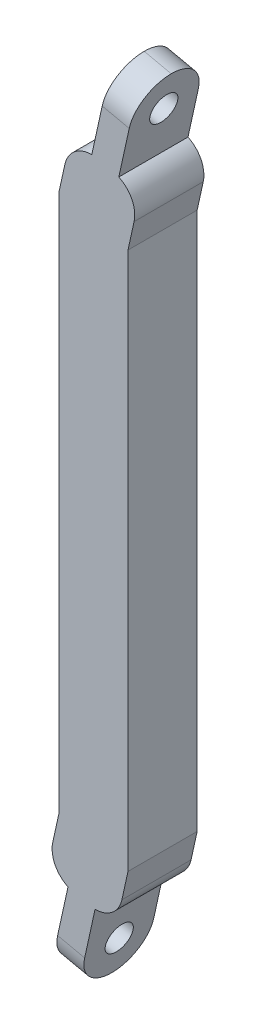
ISO-10303-21;
HEADER;
FILE_DESCRIPTION(('STEP AP214'),'2;1');
FILE_NAME('part.step','',(''),(''),'','','');
FILE_SCHEMA(('AUTOMOTIVE_DESIGN { 1 0 10303 214 1 1 1 1 }'));
ENDSEC;
DATA;
#1=APPLICATION_CONTEXT('core data for automotive mechanical design processes');
#2=APPLICATION_PROTOCOL_DEFINITION('international standard','automotive_design',2000,#1);
#3=PRODUCT_CONTEXT('',#1,'mechanical');
#4=PRODUCT('Part','Part','',(#3));
#5=PRODUCT_RELATED_PRODUCT_CATEGORY('part','',(#4));
#6=PRODUCT_DEFINITION_FORMATION('','',#4);
#7=PRODUCT_DEFINITION_CONTEXT('part definition',#1,'design');
#8=PRODUCT_DEFINITION('design','',#6,#7);
#9=PRODUCT_DEFINITION_SHAPE('','',#8);
#10=(LENGTH_UNIT() NAMED_UNIT(*) SI_UNIT(.MILLI.,.METRE.));
#11=(NAMED_UNIT(*) PLANE_ANGLE_UNIT() SI_UNIT($,.RADIAN.));
#12=(NAMED_UNIT(*) SI_UNIT($,.STERADIAN.) SOLID_ANGLE_UNIT());
#13=UNCERTAINTY_MEASURE_WITH_UNIT(LENGTH_MEASURE(1.E-05),#10,'distance_accuracy_value','');
#14=(GEOMETRIC_REPRESENTATION_CONTEXT(3) GLOBAL_UNCERTAINTY_ASSIGNED_CONTEXT((#13)) GLOBAL_UNIT_ASSIGNED_CONTEXT((#10,
#11,#12)) REPRESENTATION_CONTEXT('',''));
#15=CARTESIAN_POINT('',(0.,0.,0.));
#16=DIRECTION('',(0.,0.,1.));
#17=DIRECTION('',(1.,0.,0.));
#18=AXIS2_PLACEMENT_3D('',#15,#16,#17);
#19=CARTESIAN_POINT('',(-15.875,127.,-15.875));
#20=DIRECTION('',(1.,0.,0.));
#21=DIRECTION('',(0.,0.,-1.));
#22=AXIS2_PLACEMENT_3D('',#19,#20,#21);
#23=PLANE('',#22);
#24=DIRECTION('',(0.,-1.,0.));
#25=VECTOR('',#24,1.);
#26=CARTESIAN_POINT('',(-15.875,127.,-15.875));
#27=LINE('',#26,#25);
#28=CARTESIAN_POINT('',(-15.875,127.,-15.875));
#29=VERTEX_POINT('',#28);
#30=CARTESIAN_POINT('',(-15.8750000000005,-120.017182130584,-15.875));
#31=VERTEX_POINT('',#30);
#32=EDGE_CURVE('E295',#29,#31,#27,.T.);
#33=ORIENTED_EDGE('',*,*,#32,.T.);
#34=DIRECTION('',(0.,0.,-1.));
#35=VECTOR('',#34,1.);
#36=CARTESIAN_POINT('',(-15.8750000000005,-120.017182130584,15.875));
#37=LINE('',#36,#35);
#38=CARTESIAN_POINT('',(-15.8750000000005,-120.017182130584,15.875));
#39=VERTEX_POINT('',#38);
#40=EDGE_CURVE('E244',#39,#31,#37,.T.);
#41=ORIENTED_EDGE('',*,*,#40,.F.);
#42=DIRECTION('',(0.,-1.,0.));
#43=VECTOR('',#42,1.);
#44=CARTESIAN_POINT('',(-15.875,127.,15.875));
#45=LINE('',#44,#43);
#46=CARTESIAN_POINT('',(-15.875,127.,15.875));
#47=VERTEX_POINT('',#46);
#48=EDGE_CURVE('E306',#47,#39,#45,.T.);
#49=ORIENTED_EDGE('',*,*,#48,.F.);
#50=DIRECTION('',(0.,0.,1.));
#51=VECTOR('',#50,1.);
#52=CARTESIAN_POINT('',(-15.875,127.,-15.875));
#53=LINE('',#52,#51);
#54=EDGE_CURVE('E293',#29,#47,#53,.T.);
#55=ORIENTED_EDGE('',*,*,#54,.F.);
#56=EDGE_LOOP('',(#33,#41,#49,#55));
#57=FACE_BOUND('',#56,.T.);
#58=ADVANCED_FACE('F33',(#57),#23,.F.);
#59=CARTESIAN_POINT('',(-15.875,127.,15.875));
#60=DIRECTION('',(0.,0.,-1.));
#61=DIRECTION('',(-1.,0.,0.));
#62=AXIS2_PLACEMENT_3D('',#59,#60,#61);
#63=PLANE('',#62);
#64=DIRECTION('',(0.214797756747001,0.976658550209057,0.));
#65=VECTOR('',#64,1.);
#66=CARTESIAN_POINT('',(-11.6592062074002,-146.951409086287,15.875));
#67=LINE('',#66,#65);
#68=CARTESIAN_POINT('',(-16.4330863511022,-168.657645364683,15.875));
#69=VERTEX_POINT('',#68);
#70=CARTESIAN_POINT('',(-11.6592062074002,-146.951409086287,15.875));
#71=VERTEX_POINT('',#70);
#72=EDGE_CURVE('E221',#69,#71,#67,.T.);
#73=ORIENTED_EDGE('',*,*,#72,.F.);
#74=DIRECTION('',(-0.976658550209054,0.214797756747012,0.));
#75=VECTOR('',#74,1.);
#76=CARTESIAN_POINT('',(-4.02952276344705,-171.38557687537,15.875));
#77=LINE('',#76,#75);
#78=CARTESIAN_POINT('',(-4.02952276344722,-171.38557687537,15.875));
#79=VERTEX_POINT('',#78);
#80=EDGE_CURVE('E209',#69,#79,#77,.F.);
#81=ORIENTED_EDGE('',*,*,#80,.T.);
#82=DIRECTION('',(-0.214797756747001,-0.976658550209057,0.));
#83=VECTOR('',#82,1.);
#84=CARTESIAN_POINT('',(0.74435738025485,-149.679340596974,15.875));
#85=LINE('',#84,#83);
#86=CARTESIAN_POINT('',(0.74435738025485,-149.679340596974,15.875));
#87=VERTEX_POINT('',#86);
#88=EDGE_CURVE('E200',#87,#79,#85,.T.);
#89=ORIENTED_EDGE('',*,*,#88,.F.);
#90=CARTESIAN_POINT('',(0.676670230090281,-136.979520974251,15.875));
#91=DIRECTION('',(0.,0.,-1.));
#92=DIRECTION('',(-1.,0.,0.));
#93=AXIS2_PLACEMENT_3D('',#90,#91,#92);
#94=CIRCLE('',#93,12.7);
#95=CARTESIAN_POINT('',(13.0802338177453,-139.707452484938,15.875));
#96=VERTEX_POINT('',#95);
#97=EDGE_CURVE('E184',#87,#96,#94,.F.);
#98=ORIENTED_EDGE('',*,*,#97,.T.);
#99=DIRECTION('',(-0.214797756747001,-0.976658550209056,0.));
#100=VECTOR('',#99,1.);
#101=CARTESIAN_POINT('',(15.8749999999996,-127.,15.875));
#102=LINE('',#101,#100);
#103=CARTESIAN_POINT('',(15.8749999999996,-127.,15.875));
#104=VERTEX_POINT('',#103);
#105=EDGE_CURVE('E239',#104,#96,#102,.T.);
#106=ORIENTED_EDGE('',*,*,#105,.F.);
#107=DIRECTION('',(0.,-1.,0.));
#108=VECTOR('',#107,1.);
#109=CARTESIAN_POINT('',(15.875,127.,15.875));
#110=LINE('',#109,#108);
#111=CARTESIAN_POINT('',(15.875,120.017182130584,15.875));
#112=VERTEX_POINT('',#111);
#113=EDGE_CURVE('E303',#112,#104,#110,.T.);
#114=ORIENTED_EDGE('',*,*,#113,.F.);
#115=DIRECTION('',(-0.214797756747012,-0.976658550209054,0.));
#116=VECTOR('',#115,1.);
#117=CARTESIAN_POINT('',(15.875,120.017182130584,15.875));
#118=LINE('',#117,#116);
#119=CARTESIAN_POINT('',(18.6699211657765,132.725339306224,15.875));
#120=VERTEX_POINT('',#119);
#121=EDGE_CURVE('E263',#120,#112,#118,.T.);
#122=ORIENTED_EDGE('',*,*,#121,.F.);
#123=CARTESIAN_POINT('',(6.26635757812156,135.453270816911,15.875));
#124=DIRECTION('',(0.,0.,-1.));
#125=DIRECTION('',(-1.,0.,0.));
#126=AXIS2_PLACEMENT_3D('',#123,#124,#125);
#127=CIRCLE('',#126,12.7);
#128=CARTESIAN_POINT('',(11.6592062074004,146.951409086287,15.875));
#129=VERTEX_POINT('',#128);
#130=EDGE_CURVE('E195',#120,#129,#127,.F.);
#131=ORIENTED_EDGE('',*,*,#130,.T.);
#132=DIRECTION('',(-0.214797756746998,-0.976658550209057,0.));
#133=VECTOR('',#132,1.);
#134=CARTESIAN_POINT('',(19.843000739461,184.162099849252,15.875));
#135=LINE('',#134,#133);
#136=CARTESIAN_POINT('',(16.4330863511024,168.657645364683,15.875));
#137=VERTEX_POINT('',#136);
#138=EDGE_CURVE('E227',#137,#129,#135,.T.);
#139=ORIENTED_EDGE('',*,*,#138,.F.);
#140=DIRECTION('',(0.976658550209055,-0.21479775674701,0.));
#141=VECTOR('',#140,1.);
#142=CARTESIAN_POINT('',(4.02952276344725,171.38557687537,15.875));
#143=LINE('',#142,#141);
#144=CARTESIAN_POINT('',(4.02952276344726,171.38557687537,15.875));
#145=VERTEX_POINT('',#144);
#146=EDGE_CURVE('E342',#137,#145,#143,.F.);
#147=ORIENTED_EDGE('',*,*,#146,.T.);
#148=DIRECTION('',(0.214797756747009,0.976658550209055,0.));
#149=VECTOR('',#148,1.);
#150=CARTESIAN_POINT('',(39.9464552849093,334.695379433892,15.875));
#151=LINE('',#150,#149);
#152=CARTESIAN_POINT('',(-0.744357380255023,149.679340596974,15.875));
#153=VERTEX_POINT('',#152);
#154=EDGE_CURVE('E219',#153,#145,#151,.T.);
#155=ORIENTED_EDGE('',*,*,#154,.F.);
#156=CARTESIAN_POINT('',(-0.676670230090536,136.979520974251,15.875));
#157=DIRECTION('',(0.,0.,-1.));
#158=DIRECTION('',(-1.,0.,0.));
#159=AXIS2_PLACEMENT_3D('',#156,#157,#158);
#160=CIRCLE('',#159,12.7);
#161=CARTESIAN_POINT('',(-13.0802338177455,139.707452484938,15.875));
#162=VERTEX_POINT('',#161);
#163=EDGE_CURVE('E326',#153,#162,#160,.F.);
#164=ORIENTED_EDGE('',*,*,#163,.T.);
#165=DIRECTION('',(0.214797756747012,0.976658550209054,0.));
#166=VECTOR('',#165,1.);
#167=CARTESIAN_POINT('',(-15.875,127.,15.875));
#168=LINE('',#167,#166);
#169=EDGE_CURVE('E260',#47,#162,#168,.T.);
#170=ORIENTED_EDGE('',*,*,#169,.F.);
#171=ORIENTED_EDGE('',*,*,#48,.T.);
#172=DIRECTION('',(0.214797756747,0.976658550209057,0.));
#173=VECTOR('',#172,1.);
#174=CARTESIAN_POINT('',(-15.8750000000005,-120.017182130584,15.875));
#175=LINE('',#174,#173);
#176=CARTESIAN_POINT('',(-18.6699211657769,-132.725339306224,15.875));
#177=VERTEX_POINT('',#176);
#178=EDGE_CURVE('E241',#177,#39,#175,.T.);
#179=ORIENTED_EDGE('',*,*,#178,.F.);
#180=CARTESIAN_POINT('',(-6.26635757812182,-135.453270816911,15.875));
#181=DIRECTION('',(0.,0.,-1.));
#182=DIRECTION('',(-1.,0.,0.));
#183=AXIS2_PLACEMENT_3D('',#180,#181,#182);
#184=CIRCLE('',#183,12.7);
#185=EDGE_CURVE('E194',#177,#71,#184,.F.);
#186=ORIENTED_EDGE('',*,*,#185,.T.);
#187=EDGE_LOOP('',(#73,#81,#89,#98,#106,#114,#122,#131,#139,#147,#155,#164,#170,#171,#179,#186));
#188=FACE_BOUND('',#187,.T.);
#189=ADVANCED_FACE('F207',(#188),#63,.F.);
#190=CARTESIAN_POINT('',(15.875,127.,-15.875));
#191=DIRECTION('',(-1.,0.,0.));
#192=DIRECTION('',(0.,0.,1.));
#193=AXIS2_PLACEMENT_3D('',#190,#191,#192);
#194=PLANE('',#193);
#195=DIRECTION('',(0.,-1.,0.));
#196=VECTOR('',#195,1.);
#197=CARTESIAN_POINT('',(15.875,127.,-15.875));
#198=LINE('',#197,#196);
#199=CARTESIAN_POINT('',(15.875,120.017182130584,-15.875));
#200=VERTEX_POINT('',#199);
#201=CARTESIAN_POINT('',(15.875,-127.,-15.875));
#202=VERTEX_POINT('',#201);
#203=EDGE_CURVE('E300',#200,#202,#198,.T.);
#204=ORIENTED_EDGE('',*,*,#203,.F.);
#205=DIRECTION('',(0.,0.,-1.));
#206=VECTOR('',#205,1.);
#207=CARTESIAN_POINT('',(15.875,120.017182130584,15.875));
#208=LINE('',#207,#206);
#209=EDGE_CURVE('E266',#112,#200,#208,.T.);
#210=ORIENTED_EDGE('',*,*,#209,.F.);
#211=ORIENTED_EDGE('',*,*,#113,.T.);
#212=DIRECTION('',(0.,0.,-1.));
#213=VECTOR('',#212,1.);
#214=CARTESIAN_POINT('',(15.875,-127.,-15.875));
#215=LINE('',#214,#213);
#216=EDGE_CURVE('E292',#104,#202,#215,.T.);
#217=ORIENTED_EDGE('',*,*,#216,.T.);
#218=EDGE_LOOP('',(#204,#210,#211,#217));
#219=FACE_BOUND('',#218,.T.);
#220=ADVANCED_FACE('F387',(#219),#194,.F.);
#221=CARTESIAN_POINT('',(-15.875,127.,-15.875));
#222=DIRECTION('',(0.,0.,1.));
#223=DIRECTION('',(1.,0.,0.));
#224=AXIS2_PLACEMENT_3D('',#221,#222,#223);
#225=PLANE('',#224);
#226=DIRECTION('',(0.214797756747001,0.976658550209057,0.));
#227=VECTOR('',#226,1.);
#228=CARTESIAN_POINT('',(0.744357380254849,-149.679340596974,-15.875));
#229=LINE('',#228,#227);
#230=CARTESIAN_POINT('',(-4.02952276344722,-171.38557687537,-15.875));
#231=VERTEX_POINT('',#230);
#232=CARTESIAN_POINT('',(0.74435738025485,-149.679340596974,-15.875));
#233=VERTEX_POINT('',#232);
#234=EDGE_CURVE('E202',#231,#233,#229,.T.);
#235=ORIENTED_EDGE('',*,*,#234,.F.);
#236=DIRECTION('',(-0.976658550209054,0.214797756747012,0.));
#237=VECTOR('',#236,1.);
#238=CARTESIAN_POINT('',(-16.433086351102,-168.657645364683,-15.875));
#239=LINE('',#238,#237);
#240=CARTESIAN_POINT('',(-16.4330863511022,-168.657645364683,-15.875));
#241=VERTEX_POINT('',#240);
#242=EDGE_CURVE('E352',#231,#241,#239,.T.);
#243=ORIENTED_EDGE('',*,*,#242,.T.);
#244=DIRECTION('',(-0.214797756747001,-0.976658550209057,0.));
#245=VECTOR('',#244,1.);
#246=CARTESIAN_POINT('',(-11.6592062074002,-146.951409086287,-15.875));
#247=LINE('',#246,#245);
#248=CARTESIAN_POINT('',(-11.6592062074002,-146.951409086287,-15.875));
#249=VERTEX_POINT('',#248);
#250=EDGE_CURVE('E216',#249,#241,#247,.T.);
#251=ORIENTED_EDGE('',*,*,#250,.F.);
#252=CARTESIAN_POINT('',(-6.26635757812182,-135.453270816911,-15.875));
#253=DIRECTION('',(0.,0.,1.));
#254=DIRECTION('',(1.,0.,0.));
#255=AXIS2_PLACEMENT_3D('',#252,#253,#254);
#256=CIRCLE('',#255,12.7);
#257=CARTESIAN_POINT('',(-18.6699211657769,-132.725339306224,-15.875));
#258=VERTEX_POINT('',#257);
#259=EDGE_CURVE('E322',#249,#258,#256,.F.);
#260=ORIENTED_EDGE('',*,*,#259,.T.);
#261=DIRECTION('',(0.214797756747,0.976658550209057,0.));
#262=VECTOR('',#261,1.);
#263=CARTESIAN_POINT('',(-15.8750000000005,-120.017182130584,-15.875));
#264=LINE('',#263,#262);
#265=EDGE_CURVE('E242',#258,#31,#264,.T.);
#266=ORIENTED_EDGE('',*,*,#265,.T.);
#267=ORIENTED_EDGE('',*,*,#32,.F.);
#268=DIRECTION('',(0.214797756747012,0.976658550209054,0.));
#269=VECTOR('',#268,1.);
#270=CARTESIAN_POINT('',(-15.875,127.,-15.875));
#271=LINE('',#270,#269);
#272=CARTESIAN_POINT('',(-13.0802338177455,139.707452484938,-15.875));
#273=VERTEX_POINT('',#272);
#274=EDGE_CURVE('E259',#29,#273,#271,.T.);
#275=ORIENTED_EDGE('',*,*,#274,.T.);
#276=CARTESIAN_POINT('',(-0.676670230090536,136.979520974251,-15.875));
#277=DIRECTION('',(0.,0.,1.));
#278=DIRECTION('',(1.,0.,0.));
#279=AXIS2_PLACEMENT_3D('',#276,#277,#278);
#280=CIRCLE('',#279,12.7);
#281=CARTESIAN_POINT('',(-0.744357380255023,149.679340596974,-15.875));
#282=VERTEX_POINT('',#281);
#283=EDGE_CURVE('E315',#273,#282,#280,.F.);
#284=ORIENTED_EDGE('',*,*,#283,.T.);
#285=DIRECTION('',(-0.214797756747009,-0.976658550209055,0.));
#286=VECTOR('',#285,1.);
#287=CARTESIAN_POINT('',(39.9464552849093,334.695379433892,-15.875));
#288=LINE('',#287,#286);
#289=CARTESIAN_POINT('',(4.02952276344726,171.38557687537,-15.875));
#290=VERTEX_POINT('',#289);
#291=EDGE_CURVE('E225',#290,#282,#288,.T.);
#292=ORIENTED_EDGE('',*,*,#291,.F.);
#293=DIRECTION('',(0.976658550209055,-0.21479775674701,0.));
#294=VECTOR('',#293,1.);
#295=CARTESIAN_POINT('',(16.4330863511021,168.657645364683,-15.875));
#296=LINE('',#295,#294);
#297=CARTESIAN_POINT('',(16.4330863511024,168.657645364683,-15.875));
#298=VERTEX_POINT('',#297);
#299=EDGE_CURVE('E350',#290,#298,#296,.T.);
#300=ORIENTED_EDGE('',*,*,#299,.T.);
#301=DIRECTION('',(0.214797756746998,0.976658550209057,0.));
#302=VECTOR('',#301,1.);
#303=CARTESIAN_POINT('',(19.843000739461,184.162099849252,-15.875));
#304=LINE('',#303,#302);
#305=CARTESIAN_POINT('',(11.6592062074004,146.951409086287,-15.875));
#306=VERTEX_POINT('',#305);
#307=EDGE_CURVE('E232',#306,#298,#304,.T.);
#308=ORIENTED_EDGE('',*,*,#307,.F.);
#309=CARTESIAN_POINT('',(6.26635757812156,135.453270816911,-15.875));
#310=DIRECTION('',(0.,0.,1.));
#311=DIRECTION('',(1.,0.,0.));
#312=AXIS2_PLACEMENT_3D('',#309,#310,#311);
#313=CIRCLE('',#312,12.7);
#314=CARTESIAN_POINT('',(18.6699211657765,132.725339306224,-15.875));
#315=VERTEX_POINT('',#314);
#316=EDGE_CURVE('E318',#306,#315,#313,.F.);
#317=ORIENTED_EDGE('',*,*,#316,.T.);
#318=DIRECTION('',(-0.214797756747012,-0.976658550209054,0.));
#319=VECTOR('',#318,1.);
#320=CARTESIAN_POINT('',(15.875,120.017182130584,-15.875));
#321=LINE('',#320,#319);
#322=EDGE_CURVE('E264',#315,#200,#321,.T.);
#323=ORIENTED_EDGE('',*,*,#322,.T.);
#324=ORIENTED_EDGE('',*,*,#203,.T.);
#325=DIRECTION('',(-0.214797756747001,-0.976658550209056,0.));
#326=VECTOR('',#325,1.);
#327=CARTESIAN_POINT('',(15.8749999999996,-127.,-15.875));
#328=LINE('',#327,#326);
#329=CARTESIAN_POINT('',(13.0802338177453,-139.707452484938,-15.875));
#330=VERTEX_POINT('',#329);
#331=EDGE_CURVE('E234',#202,#330,#328,.T.);
#332=ORIENTED_EDGE('',*,*,#331,.T.);
#333=CARTESIAN_POINT('',(0.676670230090281,-136.979520974251,-15.875));
#334=DIRECTION('',(0.,0.,1.));
#335=DIRECTION('',(1.,0.,0.));
#336=AXIS2_PLACEMENT_3D('',#333,#334,#335);
#337=CIRCLE('',#336,12.7);
#338=EDGE_CURVE('E320',#330,#233,#337,.F.);
#339=ORIENTED_EDGE('',*,*,#338,.T.);
#340=EDGE_LOOP('',(#235,#243,#251,#260,#266,#267,#275,#284,#292,#300,#308,#317,#323,#324,#332,#339));
#341=FACE_BOUND('',#340,.T.);
#342=ADVANCED_FACE('F363',(#341),#225,.F.);
#343=CARTESIAN_POINT('',(-15.875,127.,15.875));
#344=DIRECTION('',(-0.976658550209054,0.214797756747012,0.));
#345=DIRECTION('',(-0.214797756747012,-0.976658550209054,0.));
#346=AXIS2_PLACEMENT_3D('',#343,#344,#345);
#347=PLANE('',#346);
#348=ORIENTED_EDGE('',*,*,#169,.T.);
#349=DIRECTION('',(0.,0.,-1.));
#350=VECTOR('',#349,1.);
#351=CARTESIAN_POINT('',(-13.0802338177455,139.707452484938,-15.875));
#352=LINE('',#351,#350);
#353=EDGE_CURVE('E336',#162,#273,#352,.T.);
#354=ORIENTED_EDGE('',*,*,#353,.T.);
#355=ORIENTED_EDGE('',*,*,#274,.F.);
#356=ORIENTED_EDGE('',*,*,#54,.T.);
#357=EDGE_LOOP('',(#348,#354,#355,#356));
#358=FACE_BOUND('',#357,.T.);
#359=ADVANCED_FACE('F399',(#358),#347,.T.);
#360=CARTESIAN_POINT('',(15.875,120.017182130584,15.875));
#361=DIRECTION('',(0.976658550209054,-0.214797756747011,0.));
#362=DIRECTION('',(0.214797756747011,0.976658550209054,0.));
#363=AXIS2_PLACEMENT_3D('',#360,#361,#362);
#364=PLANE('',#363);
#365=ORIENTED_EDGE('',*,*,#322,.F.);
#366=DIRECTION('',(0.,0.,1.));
#367=VECTOR('',#366,1.);
#368=CARTESIAN_POINT('',(18.6699211657765,132.725339306224,15.875));
#369=LINE('',#368,#367);
#370=EDGE_CURVE('E333',#315,#120,#369,.T.);
#371=ORIENTED_EDGE('',*,*,#370,.T.);
#372=ORIENTED_EDGE('',*,*,#121,.T.);
#373=ORIENTED_EDGE('',*,*,#209,.T.);
#374=EDGE_LOOP('',(#365,#371,#372,#373));
#375=FACE_BOUND('',#374,.T.);
#376=ADVANCED_FACE('F383',(#375),#364,.T.);
#377=CARTESIAN_POINT('',(15.8749999999996,-127.,15.875));
#378=DIRECTION('',(0.976658550209056,-0.214797756747001,0.));
#379=DIRECTION('',(0.214797756747001,0.976658550209057,0.));
#380=AXIS2_PLACEMENT_3D('',#377,#378,#379);
#381=PLANE('',#380);
#382=ORIENTED_EDGE('',*,*,#105,.T.);
#383=DIRECTION('',(0.,0.,-1.));
#384=VECTOR('',#383,1.);
#385=CARTESIAN_POINT('',(13.0802338177453,-139.707452484938,-15.875));
#386=LINE('',#385,#384);
#387=EDGE_CURVE('E189',#96,#330,#386,.T.);
#388=ORIENTED_EDGE('',*,*,#387,.T.);
#389=ORIENTED_EDGE('',*,*,#331,.F.);
#390=ORIENTED_EDGE('',*,*,#216,.F.);
#391=EDGE_LOOP('',(#382,#388,#389,#390));
#392=FACE_BOUND('',#391,.T.);
#393=ADVANCED_FACE('F389',(#392),#381,.T.);
#394=CARTESIAN_POINT('',(-15.8750000000005,-120.017182130584,15.875));
#395=DIRECTION('',(-0.976658550209057,0.214797756747,0.));
#396=DIRECTION('',(-0.214797756747,-0.976658550209057,0.));
#397=AXIS2_PLACEMENT_3D('',#394,#395,#396);
#398=PLANE('',#397);
#399=ORIENTED_EDGE('',*,*,#265,.F.);
#400=DIRECTION('',(0.,0.,1.));
#401=VECTOR('',#400,1.);
#402=CARTESIAN_POINT('',(-18.6699211657769,-132.725339306224,15.875));
#403=LINE('',#402,#401);
#404=EDGE_CURVE('E324',#258,#177,#403,.T.);
#405=ORIENTED_EDGE('',*,*,#404,.T.);
#406=ORIENTED_EDGE('',*,*,#178,.T.);
#407=ORIENTED_EDGE('',*,*,#40,.T.);
#408=EDGE_LOOP('',(#399,#405,#406,#407));
#409=FACE_BOUND('',#408,.T.);
#410=ADVANCED_FACE('F391',(#409),#398,.T.);
#411=CARTESIAN_POINT('',(19.843000739461,184.162099849252,-216.876625002354));
#412=DIRECTION('',(-0.976658550209057,0.214797756746998,0.));
#413=DIRECTION('',(-0.214797756746998,-0.976658550209057,0.));
#414=AXIS2_PLACEMENT_3D('',#411,#412,#413);
#415=PLANE('',#414);
#416=CARTESIAN_POINT('',(16.4330863511046,168.657645364683,0.));
#417=DIRECTION('',(0.976658550209054,-0.214797756747011,0.));
#418=DIRECTION('',(0.214797756747011,0.976658550209054,0.));
#419=AXIS2_PLACEMENT_3D('',#416,#417,#418);
#420=CIRCLE('',#419,6.34999999999999);
#421=CARTESIAN_POINT('',(17.7970521064481,174.85942715851,0.));
#422=VERTEX_POINT('',#421);
#423=EDGE_CURVE('E667',#422,#422,#420,.T.);
#424=ORIENTED_EDGE('',*,*,#423,.F.);
#425=EDGE_LOOP('',(#424));
#426=FACE_BOUND('',#425,.T.);
#427=CARTESIAN_POINT('',(16.4330863511024,168.657645364683,0.));
#428=DIRECTION('',(-0.976658550209057,0.214797756746998,0.));
#429=DIRECTION('',(-0.214797756746998,-0.976658550209057,0.));
#430=AXIS2_PLACEMENT_3D('',#427,#428,#429);
#431=CIRCLE('',#430,15.875);
#432=CARTESIAN_POINT('',(19.843000739461,184.162099849252,0.));
#433=VERTEX_POINT('',#432);
#434=EDGE_CURVE('E57',#298,#433,#431,.F.);
#435=ORIENTED_EDGE('',*,*,#434,.T.);
#436=CARTESIAN_POINT('',(16.4330863511024,168.657645364683,0.));
#437=DIRECTION('',(-0.976658550209057,0.214797756746998,0.));
#438=DIRECTION('',(-0.214797756746998,-0.976658550209057,0.));
#439=AXIS2_PLACEMENT_3D('',#436,#437,#438);
#440=CIRCLE('',#439,15.875);
#441=EDGE_CURVE('E355',#433,#137,#440,.F.);
#442=ORIENTED_EDGE('',*,*,#441,.T.);
#443=ORIENTED_EDGE('',*,*,#138,.T.);
#444=DIRECTION('',(0.,0.,1.));
#445=VECTOR('',#444,1.);
#446=CARTESIAN_POINT('',(11.6592062074004,146.951409086287,-216.876625002354));
#447=LINE('',#446,#445);
#448=EDGE_CURVE('E235',#306,#129,#447,.T.);
#449=ORIENTED_EDGE('',*,*,#448,.F.);
#450=ORIENTED_EDGE('',*,*,#307,.T.);
#451=EDGE_LOOP('',(#435,#442,#443,#449,#450));
#452=FACE_BOUND('',#451,.T.);
#453=ADVANCED_FACE('F373',(#426,#452),#415,.F.);
#454=CARTESIAN_POINT('',(39.9464552849093,334.695379433892,-216.876625002354));
#455=DIRECTION('',(0.976658550209054,-0.214797756747009,0.));
#456=DIRECTION('',(0.214797756747009,0.976658550209055,0.));
#457=AXIS2_PLACEMENT_3D('',#454,#455,#456);
#458=PLANE('',#457);
#459=CARTESIAN_POINT('',(4.02952276344722,171.38557687537,0.));
#460=DIRECTION('',(0.976658550209054,-0.214797756747009,0.));
#461=DIRECTION('',(0.214797756747009,0.976658550209055,0.));
#462=AXIS2_PLACEMENT_3D('',#459,#460,#461);
#463=CIRCLE('',#462,6.34999999999999);
#464=CARTESIAN_POINT('',(5.39348851879073,177.587358669198,0.));
#465=VERTEX_POINT('',#464);
#466=EDGE_CURVE('E369',#465,#465,#463,.F.);
#467=ORIENTED_EDGE('',*,*,#466,.F.);
#468=EDGE_LOOP('',(#467));
#469=FACE_BOUND('',#468,.T.);
#470=ORIENTED_EDGE('',*,*,#154,.T.);
#471=CARTESIAN_POINT('',(4.02952276344727,171.38557687537,0.));
#472=DIRECTION('',(0.976658550209054,-0.214797756747009,0.));
#473=DIRECTION('',(0.214797756747009,0.976658550209055,0.));
#474=AXIS2_PLACEMENT_3D('',#471,#472,#473);
#475=CIRCLE('',#474,15.875);
#476=CARTESIAN_POINT('',(7.43943715180604,186.890031359939,0.));
#477=VERTEX_POINT('',#476);
#478=EDGE_CURVE('E11',#145,#477,#475,.F.);
#479=ORIENTED_EDGE('',*,*,#478,.T.);
#480=CARTESIAN_POINT('',(4.02952276344726,171.38557687537,0.));
#481=DIRECTION('',(0.976658550209054,-0.214797756747009,0.));
#482=DIRECTION('',(0.214797756747009,0.976658550209055,0.));
#483=AXIS2_PLACEMENT_3D('',#480,#481,#482);
#484=CIRCLE('',#483,15.875);
#485=EDGE_CURVE('E43',#477,#290,#484,.F.);
#486=ORIENTED_EDGE('',*,*,#485,.T.);
#487=ORIENTED_EDGE('',*,*,#291,.T.);
#488=DIRECTION('',(0.,0.,1.));
#489=VECTOR('',#488,1.);
#490=CARTESIAN_POINT('',(-0.744357380255023,149.679340596974,-216.876625002354));
#491=LINE('',#490,#489);
#492=EDGE_CURVE('E228',#282,#153,#491,.T.);
#493=ORIENTED_EDGE('',*,*,#492,.T.);
#494=EDGE_LOOP('',(#470,#479,#486,#487,#493));
#495=FACE_BOUND('',#494,.T.);
#496=ADVANCED_FACE('F358',(#469,#495),#458,.F.);
#497=CARTESIAN_POINT('',(-11.6592062074002,-146.951409086287,-216.876625002354));
#498=DIRECTION('',(0.976658550209057,-0.214797756747001,0.));
#499=DIRECTION('',(0.214797756747001,0.976658550209057,0.));
#500=AXIS2_PLACEMENT_3D('',#497,#498,#499);
#501=PLANE('',#500);
#502=CARTESIAN_POINT('',(-16.4330863511022,-168.657645364683,0.));
#503=DIRECTION('',(-0.976658550209057,0.214797756747001,0.));
#504=DIRECTION('',(-0.214797756747001,-0.976658550209057,0.));
#505=AXIS2_PLACEMENT_3D('',#502,#503,#504);
#506=CIRCLE('',#505,6.34999999999999);
#507=CARTESIAN_POINT('',(-17.7970521064456,-174.859427158511,0.));
#508=VERTEX_POINT('',#507);
#509=EDGE_CURVE('E665',#508,#508,#506,.T.);
#510=ORIENTED_EDGE('',*,*,#509,.F.);
#511=EDGE_LOOP('',(#510));
#512=FACE_BOUND('',#511,.T.);
#513=CARTESIAN_POINT('',(-16.4330863511022,-168.657645364683,0.));
#514=DIRECTION('',(0.976658550209057,-0.214797756747001,0.));
#515=DIRECTION('',(0.214797756747001,0.976658550209057,0.));
#516=AXIS2_PLACEMENT_3D('',#513,#514,#515);
#517=CIRCLE('',#516,15.875);
#518=CARTESIAN_POINT('',(-19.8430007394608,-184.162099849252,0.));
#519=VERTEX_POINT('',#518);
#520=EDGE_CURVE('E338',#241,#519,#517,.F.);
#521=ORIENTED_EDGE('',*,*,#520,.T.);
#522=CARTESIAN_POINT('',(-16.4330863511022,-168.657645364683,0.));
#523=DIRECTION('',(0.976658550209057,-0.214797756747001,0.));
#524=DIRECTION('',(0.214797756747001,0.976658550209057,0.));
#525=AXIS2_PLACEMENT_3D('',#522,#523,#524);
#526=CIRCLE('',#525,15.875);
#527=EDGE_CURVE('E340',#519,#69,#526,.F.);
#528=ORIENTED_EDGE('',*,*,#527,.T.);
#529=ORIENTED_EDGE('',*,*,#72,.T.);
#530=DIRECTION('',(0.,0.,1.));
#531=VECTOR('',#530,1.);
#532=CARTESIAN_POINT('',(-11.6592062074002,-146.951409086287,-216.876625002354));
#533=LINE('',#532,#531);
#534=EDGE_CURVE('E220',#249,#71,#533,.T.);
#535=ORIENTED_EDGE('',*,*,#534,.F.);
#536=ORIENTED_EDGE('',*,*,#250,.T.);
#537=EDGE_LOOP('',(#521,#528,#529,#535,#536));
#538=FACE_BOUND('',#537,.T.);
#539=ADVANCED_FACE('F474',(#512,#538),#501,.F.);
#540=CARTESIAN_POINT('',(0.74435738025485,-149.679340596974,-216.876625002354));
#541=DIRECTION('',(-0.976658550209057,0.214797756747001,0.));
#542=DIRECTION('',(-0.214797756747001,-0.976658550209057,0.));
#543=AXIS2_PLACEMENT_3D('',#540,#541,#542);
#544=PLANE('',#543);
#545=CARTESIAN_POINT('',(-4.02952276344719,-171.38557687537,0.));
#546=DIRECTION('',(-0.976658550209057,0.214797756747001,0.));
#547=DIRECTION('',(-0.214797756747001,-0.976658550209057,0.));
#548=AXIS2_PLACEMENT_3D('',#545,#546,#547);
#549=CIRCLE('',#548,6.34999999999999);
#550=CARTESIAN_POINT('',(-5.39348851879064,-177.587358669198,0.));
#551=VERTEX_POINT('',#550);
#552=EDGE_CURVE('E662',#551,#551,#549,.F.);
#553=ORIENTED_EDGE('',*,*,#552,.F.);
#554=EDGE_LOOP('',(#553));
#555=FACE_BOUND('',#554,.T.);
#556=ORIENTED_EDGE('',*,*,#88,.T.);
#557=CARTESIAN_POINT('',(-4.02952276344722,-171.38557687537,0.));
#558=DIRECTION('',(-0.976658550209057,0.214797756747001,0.));
#559=DIRECTION('',(-0.214797756747001,-0.976658550209057,0.));
#560=AXIS2_PLACEMENT_3D('',#557,#558,#559);
#561=CIRCLE('',#560,15.875);
#562=CARTESIAN_POINT('',(-7.43943715180586,-186.890031359939,0.));
#563=VERTEX_POINT('',#562);
#564=EDGE_CURVE('E348',#79,#563,#561,.F.);
#565=ORIENTED_EDGE('',*,*,#564,.T.);
#566=CARTESIAN_POINT('',(-4.0295227634472,-171.38557687537,0.));
#567=DIRECTION('',(-0.976658550209057,0.214797756747001,0.));
#568=DIRECTION('',(-0.214797756747001,-0.976658550209057,0.));
#569=AXIS2_PLACEMENT_3D('',#566,#567,#568);
#570=CIRCLE('',#569,15.875);
#571=EDGE_CURVE('E346',#563,#231,#570,.F.);
#572=ORIENTED_EDGE('',*,*,#571,.T.);
#573=ORIENTED_EDGE('',*,*,#234,.T.);
#574=DIRECTION('',(0.,0.,1.));
#575=VECTOR('',#574,1.);
#576=CARTESIAN_POINT('',(0.74435738025485,-149.679340596974,-216.876625002354));
#577=LINE('',#576,#575);
#578=EDGE_CURVE('E188',#233,#87,#577,.T.);
#579=ORIENTED_EDGE('',*,*,#578,.T.);
#580=EDGE_LOOP('',(#556,#565,#572,#573,#579));
#581=FACE_BOUND('',#580,.T.);
#582=ADVANCED_FACE('F199',(#555,#581),#544,.F.);
#583=CARTESIAN_POINT('',(-6.26635757812182,-135.453270816911,-216.876625002354));
#584=DIRECTION('',(0.,0.,-1.));
#585=DIRECTION('',(-1.,0.,0.));
#586=AXIS2_PLACEMENT_3D('',#583,#584,#585);
#587=CYLINDRICAL_SURFACE('',#586,12.7);
#588=ORIENTED_EDGE('',*,*,#185,.F.);
#589=ORIENTED_EDGE('',*,*,#404,.F.);
#590=ORIENTED_EDGE('',*,*,#259,.F.);
#591=ORIENTED_EDGE('',*,*,#534,.T.);
#592=EDGE_LOOP('',(#588,#589,#590,#591));
#593=FACE_BOUND('',#592,.T.);
#594=ADVANCED_FACE('F411',(#593),#587,.T.);
#595=CARTESIAN_POINT('',(0.676670230090281,-136.979520974251,-216.876625002354));
#596=DIRECTION('',(0.,0.,1.));
#597=DIRECTION('',(1.,0.,0.));
#598=AXIS2_PLACEMENT_3D('',#595,#596,#597);
#599=CYLINDRICAL_SURFACE('',#598,12.7);
#600=ORIENTED_EDGE('',*,*,#338,.F.);
#601=ORIENTED_EDGE('',*,*,#387,.F.);
#602=ORIENTED_EDGE('',*,*,#97,.F.);
#603=ORIENTED_EDGE('',*,*,#578,.F.);
#604=EDGE_LOOP('',(#600,#601,#602,#603));
#605=FACE_BOUND('',#604,.T.);
#606=ADVANCED_FACE('F187',(#605),#599,.T.);
#607=CARTESIAN_POINT('',(6.26635757812156,135.453270816911,-216.876625002354));
#608=DIRECTION('',(0.,0.,-1.));
#609=DIRECTION('',(-1.,0.,0.));
#610=AXIS2_PLACEMENT_3D('',#607,#608,#609);
#611=CYLINDRICAL_SURFACE('',#610,12.7);
#612=ORIENTED_EDGE('',*,*,#316,.F.);
#613=ORIENTED_EDGE('',*,*,#448,.T.);
#614=ORIENTED_EDGE('',*,*,#130,.F.);
#615=ORIENTED_EDGE('',*,*,#370,.F.);
#616=EDGE_LOOP('',(#612,#613,#614,#615));
#617=FACE_BOUND('',#616,.T.);
#618=ADVANCED_FACE('F380',(#617),#611,.T.);
#619=CARTESIAN_POINT('',(-0.676670230090536,136.979520974251,-216.876625002354));
#620=DIRECTION('',(0.,0.,1.));
#621=DIRECTION('',(1.,0.,0.));
#622=AXIS2_PLACEMENT_3D('',#619,#620,#621);
#623=CYLINDRICAL_SURFACE('',#622,12.7);
#624=ORIENTED_EDGE('',*,*,#283,.F.);
#625=ORIENTED_EDGE('',*,*,#353,.F.);
#626=ORIENTED_EDGE('',*,*,#163,.F.);
#627=ORIENTED_EDGE('',*,*,#492,.F.);
#628=EDGE_LOOP('',(#624,#625,#626,#627));
#629=FACE_BOUND('',#628,.T.);
#630=ADVANCED_FACE('F419',(#629),#623,.T.);
#631=CARTESIAN_POINT('',(-77.9250119283829,-155.133647986862,0.));
#632=DIRECTION('',(0.976658550209054,-0.214797756747012,0.));
#633=DIRECTION('',(0.214797756747012,0.976658550209054,0.));
#634=AXIS2_PLACEMENT_3D('',#631,#632,#633);
#635=CYLINDRICAL_SURFACE('',#634,15.875);
#636=ORIENTED_EDGE('',*,*,#242,.F.);
#637=ORIENTED_EDGE('',*,*,#571,.F.);
#638=DIRECTION('',(-0.976658550209054,0.214797756747012,0.));
#639=VECTOR('',#638,1.);
#640=CARTESIAN_POINT('',(-7.43943715180585,-186.890031359939,0.));
#641=LINE('',#640,#639);
#642=EDGE_CURVE('E210',#519,#563,#641,.F.);
#643=ORIENTED_EDGE('',*,*,#642,.F.);
#644=ORIENTED_EDGE('',*,*,#520,.F.);
#645=EDGE_LOOP('',(#636,#637,#643,#644));
#646=FACE_BOUND('',#645,.T.);
#647=ADVANCED_FACE('F422',(#646),#635,.T.);
#648=CARTESIAN_POINT('',(5.64525683492385,-173.513363453706,0.));
#649=DIRECTION('',(0.976658550209054,-0.214797756747012,0.));
#650=DIRECTION('',(0.214797756747012,0.976658550209054,0.));
#651=AXIS2_PLACEMENT_3D('',#648,#649,#650);
#652=CYLINDRICAL_SURFACE('',#651,15.875);
#653=ORIENTED_EDGE('',*,*,#564,.F.);
#654=ORIENTED_EDGE('',*,*,#80,.F.);
#655=ORIENTED_EDGE('',*,*,#527,.F.);
#656=ORIENTED_EDGE('',*,*,#642,.T.);
#657=EDGE_LOOP('',(#653,#654,#655,#656));
#658=FACE_BOUND('',#657,.T.);
#659=ADVANCED_FACE('F424',(#658),#652,.T.);
#660=CARTESIAN_POINT('',(-5.64525683492367,173.513363453706,0.));
#661=DIRECTION('',(-0.976658550209055,0.21479775674701,0.));
#662=DIRECTION('',(-0.21479775674701,-0.976658550209055,0.));
#663=AXIS2_PLACEMENT_3D('',#660,#661,#662);
#664=CYLINDRICAL_SURFACE('',#663,15.875);
#665=ORIENTED_EDGE('',*,*,#299,.F.);
#666=ORIENTED_EDGE('',*,*,#485,.F.);
#667=DIRECTION('',(0.976658550209055,-0.21479775674701,0.));
#668=VECTOR('',#667,1.);
#669=CARTESIAN_POINT('',(7.43943715180604,186.890031359939,0.));
#670=LINE('',#669,#668);
#671=EDGE_CURVE('E37',#433,#477,#670,.F.);
#672=ORIENTED_EDGE('',*,*,#671,.F.);
#673=ORIENTED_EDGE('',*,*,#434,.F.);
#674=EDGE_LOOP('',(#665,#666,#672,#673));
#675=FACE_BOUND('',#674,.T.);
#676=ADVANCED_FACE('F35',(#675),#664,.T.);
#677=CARTESIAN_POINT('',(-5.64525683492354,173.513363453706,0.));
#678=DIRECTION('',(-0.976658550209055,0.21479775674701,0.));
#679=DIRECTION('',(-0.21479775674701,-0.976658550209055,0.));
#680=AXIS2_PLACEMENT_3D('',#677,#678,#679);
#681=CYLINDRICAL_SURFACE('',#680,15.875);
#682=ORIENTED_EDGE('',*,*,#478,.F.);
#683=ORIENTED_EDGE('',*,*,#146,.F.);
#684=ORIENTED_EDGE('',*,*,#441,.F.);
#685=ORIENTED_EDGE('',*,*,#671,.T.);
#686=EDGE_LOOP('',(#682,#683,#684,#685));
#687=FACE_BOUND('',#686,.T.);
#688=ADVANCED_FACE('F371',(#687),#681,.T.);
#689=CARTESIAN_POINT('',(-13.5117650839715,175.243454615009,0.));
#690=DIRECTION('',(0.976658550209054,-0.214797756747011,0.));
#691=DIRECTION('',(0.214797756747011,0.976658550209054,0.));
#692=AXIS2_PLACEMENT_3D('',#689,#690,#691);
#693=CYLINDRICAL_SURFACE('',#692,6.34999999999999);
#694=ORIENTED_EDGE('',*,*,#466,.T.);
#695=EDGE_LOOP('',(#694));
#696=FACE_BOUND('',#695,.T.);
#697=ORIENTED_EDGE('',*,*,#423,.T.);
#698=EDGE_LOOP('',(#697));
#699=FACE_BOUND('',#698,.T.);
#700=ADVANCED_FACE('F431',(#696,#699),#693,.F.);
#701=CARTESIAN_POINT('',(13.5117650839716,-175.243454615009,0.));
#702=DIRECTION('',(-0.976658550209057,0.214797756747001,0.));
#703=DIRECTION('',(-0.214797756747001,-0.976658550209057,0.));
#704=AXIS2_PLACEMENT_3D('',#701,#702,#703);
#705=CYLINDRICAL_SURFACE('',#704,6.34999999999999);
#706=ORIENTED_EDGE('',*,*,#552,.T.);
#707=EDGE_LOOP('',(#706));
#708=FACE_BOUND('',#707,.T.);
#709=ORIENTED_EDGE('',*,*,#509,.T.);
#710=EDGE_LOOP('',(#709));
#711=FACE_BOUND('',#710,.T.);
#712=ADVANCED_FACE('F436',(#708,#711),#705,.F.);
#713=CLOSED_SHELL('',(#58,#189,#220,#342,#359,#376,#393,#410,#453,#496,#539,#582,#594,#606,#618,
#630,#647,#659,#676,#688,#700,#712));
#714=CARTESIAN_POINT('',(15.8749999999996,-127.,15.875));
#715=DIRECTION('',(0.214797756746999,0.976658550209057,0.));
#716=DIRECTION('',(-0.976658550209057,0.214797756746999,0.));
#717=AXIS2_PLACEMENT_3D('',#714,#715,#716);
#718=PLANE('',#717);
#719=DIRECTION('',(0.,0.,-1.));
#720=VECTOR('',#719,1.);
#721=CARTESIAN_POINT('',(12.7,-126.301718213058,-12.7));
#722=LINE('',#721,#720);
#723=CARTESIAN_POINT('',(12.7,-126.301718213058,12.7));
#724=VERTEX_POINT('',#723);
#725=CARTESIAN_POINT('',(12.7,-126.301718213058,-12.7));
#726=VERTEX_POINT('',#725);
#727=EDGE_CURVE('E312',#724,#726,#722,.T.);
#728=ORIENTED_EDGE('',*,*,#727,.T.);
#729=DIRECTION('',(-0.976658550209057,0.214797756746999,0.));
#730=VECTOR('',#729,1.);
#731=CARTESIAN_POINT('',(-64.6667571555675,-109.286348941732,-12.7));
#732=LINE('',#731,#730);
#733=CARTESIAN_POINT('',(-12.7,-120.715463917526,-12.7));
#734=VERTEX_POINT('',#733);
#735=EDGE_CURVE('E256',#726,#734,#732,.T.);
#736=ORIENTED_EDGE('',*,*,#735,.T.);
#737=DIRECTION('',(0.,0.,1.));
#738=VECTOR('',#737,1.);
#739=CARTESIAN_POINT('',(-12.7,-120.715463917526,-12.7));
#740=LINE('',#739,#738);
#741=CARTESIAN_POINT('',(-12.7,-120.715463917526,12.7));
#742=VERTEX_POINT('',#741);
#743=EDGE_CURVE('E253',#734,#742,#740,.T.);
#744=ORIENTED_EDGE('',*,*,#743,.T.);
#745=DIRECTION('',(0.976658550209057,-0.214797756746999,0.));
#746=VECTOR('',#745,1.);
#747=CARTESIAN_POINT('',(-64.6667571555675,-109.286348941732,12.7));
#748=LINE('',#747,#746);
#749=EDGE_CURVE('E250',#742,#724,#748,.T.);
#750=ORIENTED_EDGE('',*,*,#749,.T.);
#751=EDGE_LOOP('',(#728,#736,#744,#750));
#752=FACE_BOUND('',#751,.T.);
#753=ADVANCED_FACE('F577',(#752),#718,.T.);
#754=CARTESIAN_POINT('',(-15.875,127.,15.875));
#755=DIRECTION('',(-0.214797756747011,-0.976658550209054,0.));
#756=DIRECTION('',(0.976658550209054,-0.214797756747011,0.));
#757=AXIS2_PLACEMENT_3D('',#754,#755,#756);
#758=PLANE('',#757);
#759=DIRECTION('',(0.,0.,-1.));
#760=VECTOR('',#759,1.);
#761=CARTESIAN_POINT('',(-12.7,126.301718213058,-12.7));
#762=LINE('',#761,#760);
#763=CARTESIAN_POINT('',(-12.7,126.301718213058,12.7));
#764=VERTEX_POINT('',#763);
#765=CARTESIAN_POINT('',(-12.7,126.301718213058,-12.7));
#766=VERTEX_POINT('',#765);
#767=EDGE_CURVE('E275',#764,#766,#762,.T.);
#768=ORIENTED_EDGE('',*,*,#767,.T.);
#769=DIRECTION('',(0.976658550209054,-0.214797756747011,0.));
#770=VECTOR('',#769,1.);
#771=CARTESIAN_POINT('',(-12.8464883922638,126.333935591426,-12.7));
#772=LINE('',#771,#770);
#773=CARTESIAN_POINT('',(12.7,120.715463917526,-12.7));
#774=VERTEX_POINT('',#773);
#775=EDGE_CURVE('E278',#766,#774,#772,.T.);
#776=ORIENTED_EDGE('',*,*,#775,.T.);
#777=DIRECTION('',(0.,0.,1.));
#778=VECTOR('',#777,1.);
#779=CARTESIAN_POINT('',(12.7,120.715463917526,-12.7));
#780=LINE('',#779,#778);
#781=CARTESIAN_POINT('',(12.7,120.715463917526,12.7));
#782=VERTEX_POINT('',#781);
#783=EDGE_CURVE('E309',#774,#782,#780,.T.);
#784=ORIENTED_EDGE('',*,*,#783,.T.);
#785=DIRECTION('',(-0.976658550209054,0.214797756747011,0.));
#786=VECTOR('',#785,1.);
#787=CARTESIAN_POINT('',(-12.8464883922638,126.333935591426,12.7));
#788=LINE('',#787,#786);
#789=EDGE_CURVE('E272',#782,#764,#788,.T.);
#790=ORIENTED_EDGE('',*,*,#789,.T.);
#791=EDGE_LOOP('',(#768,#776,#784,#790));
#792=FACE_BOUND('',#791,.T.);
#793=ADVANCED_FACE('F566',(#792),#758,.T.);
#794=CARTESIAN_POINT('',(12.7,127.,-12.7));
#795=DIRECTION('',(-1.,0.,0.));
#796=DIRECTION('',(0.,0.,1.));
#797=AXIS2_PLACEMENT_3D('',#794,#795,#796);
#798=PLANE('',#797);
#799=ORIENTED_EDGE('',*,*,#727,.F.);
#800=DIRECTION('',(0.,-1.,0.));
#801=VECTOR('',#800,1.);
#802=CARTESIAN_POINT('',(12.7,127.,12.7));
#803=LINE('',#802,#801);
#804=EDGE_CURVE('E283',#782,#724,#803,.T.);
#805=ORIENTED_EDGE('',*,*,#804,.F.);
#806=ORIENTED_EDGE('',*,*,#783,.F.);
#807=DIRECTION('',(0.,-1.,0.));
#808=VECTOR('',#807,1.);
#809=CARTESIAN_POINT('',(12.7,127.,-12.7));
#810=LINE('',#809,#808);
#811=EDGE_CURVE('E281',#774,#726,#810,.T.);
#812=ORIENTED_EDGE('',*,*,#811,.T.);
#813=EDGE_LOOP('',(#799,#805,#806,#812));
#814=FACE_BOUND('',#813,.T.);
#815=ADVANCED_FACE('F556',(#814),#798,.T.);
#816=CARTESIAN_POINT('',(-12.7,127.,12.7));
#817=DIRECTION('',(0.,0.,-1.));
#818=DIRECTION('',(-1.,0.,0.));
#819=AXIS2_PLACEMENT_3D('',#816,#817,#818);
#820=PLANE('',#819);
#821=ORIENTED_EDGE('',*,*,#749,.F.);
#822=DIRECTION('',(0.,-1.,0.));
#823=VECTOR('',#822,1.);
#824=CARTESIAN_POINT('',(-12.7,127.,12.7));
#825=LINE('',#824,#823);
#826=EDGE_CURVE('E286',#764,#742,#825,.T.);
#827=ORIENTED_EDGE('',*,*,#826,.F.);
#828=ORIENTED_EDGE('',*,*,#789,.F.);
#829=ORIENTED_EDGE('',*,*,#804,.T.);
#830=EDGE_LOOP('',(#821,#827,#828,#829));
#831=FACE_BOUND('',#830,.T.);
#832=ADVANCED_FACE('F546',(#831),#820,.T.);
#833=CARTESIAN_POINT('',(-12.7,127.,-12.7));
#834=DIRECTION('',(1.,0.,0.));
#835=DIRECTION('',(0.,0.,-1.));
#836=AXIS2_PLACEMENT_3D('',#833,#834,#835);
#837=PLANE('',#836);
#838=ORIENTED_EDGE('',*,*,#743,.F.);
#839=DIRECTION('',(0.,-1.,0.));
#840=VECTOR('',#839,1.);
#841=CARTESIAN_POINT('',(-12.7,127.,-12.7));
#842=LINE('',#841,#840);
#843=EDGE_CURVE('E289',#766,#734,#842,.T.);
#844=ORIENTED_EDGE('',*,*,#843,.F.);
#845=ORIENTED_EDGE('',*,*,#767,.F.);
#846=ORIENTED_EDGE('',*,*,#826,.T.);
#847=EDGE_LOOP('',(#838,#844,#845,#846));
#848=FACE_BOUND('',#847,.T.);
#849=ADVANCED_FACE('F534',(#848),#837,.T.);
#850=CARTESIAN_POINT('',(-12.7,127.,-12.7));
#851=DIRECTION('',(0.,0.,1.));
#852=DIRECTION('',(1.,0.,0.));
#853=AXIS2_PLACEMENT_3D('',#850,#851,#852);
#854=PLANE('',#853);
#855=ORIENTED_EDGE('',*,*,#735,.F.);
#856=ORIENTED_EDGE('',*,*,#811,.F.);
#857=ORIENTED_EDGE('',*,*,#775,.F.);
#858=ORIENTED_EDGE('',*,*,#843,.T.);
#859=EDGE_LOOP('',(#855,#856,#857,#858));
#860=FACE_BOUND('',#859,.T.);
#861=ADVANCED_FACE('F529',(#860),#854,.T.);
#862=CLOSED_SHELL('',(#753,#793,#815,#832,#849,#861));
#863=ORIENTED_CLOSED_SHELL('',*,#862,.T.);
#864=BREP_WITH_VOIDS('B2',#713,(#863));
#865=ADVANCED_BREP_SHAPE_REPRESENTATION('',(#18,#864),#14);
#866=SHAPE_DEFINITION_REPRESENTATION(#9,#865);
ENDSEC;
END-ISO-10303-21;
